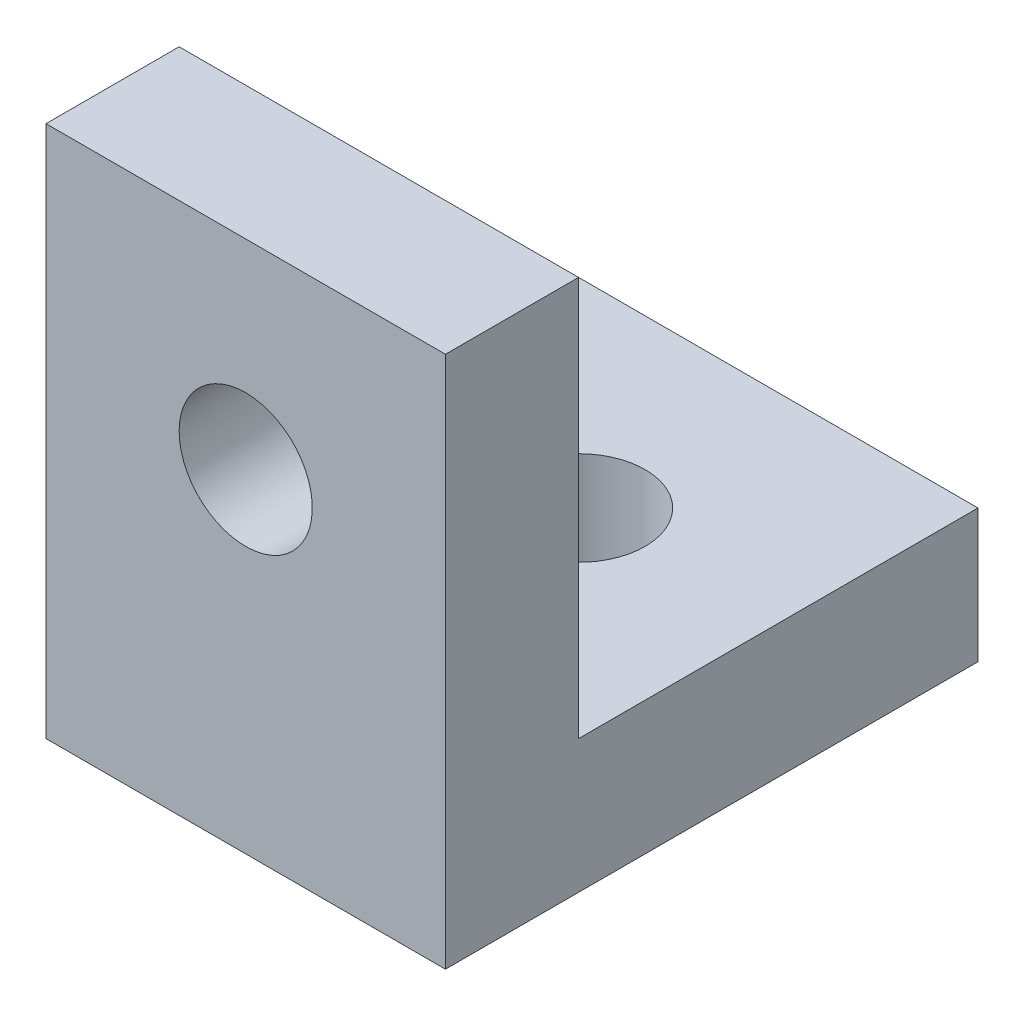
ISO-10303-21;
HEADER;
FILE_DESCRIPTION(('STEP AP214'),'2;1');
FILE_NAME('part.step','',(''),(''),'','','');
FILE_SCHEMA(('AUTOMOTIVE_DESIGN { 1 0 10303 214 1 1 1 1 }'));
ENDSEC;
DATA;
#1=APPLICATION_CONTEXT('core data for automotive mechanical design processes');
#2=APPLICATION_PROTOCOL_DEFINITION('international standard','automotive_design',2000,#1);
#3=PRODUCT_CONTEXT('',#1,'mechanical');
#4=PRODUCT('Part','Part','',(#3));
#5=PRODUCT_RELATED_PRODUCT_CATEGORY('part','',(#4));
#6=PRODUCT_DEFINITION_FORMATION('','',#4);
#7=PRODUCT_DEFINITION_CONTEXT('part definition',#1,'design');
#8=PRODUCT_DEFINITION('design','',#6,#7);
#9=PRODUCT_DEFINITION_SHAPE('','',#8);
#10=(LENGTH_UNIT() NAMED_UNIT(*) SI_UNIT(.MILLI.,.METRE.));
#11=(NAMED_UNIT(*) PLANE_ANGLE_UNIT() SI_UNIT($,.RADIAN.));
#12=(NAMED_UNIT(*) SI_UNIT($,.STERADIAN.) SOLID_ANGLE_UNIT());
#13=UNCERTAINTY_MEASURE_WITH_UNIT(LENGTH_MEASURE(1.E-05),#10,'distance_accuracy_value','');
#14=(GEOMETRIC_REPRESENTATION_CONTEXT(3) GLOBAL_UNCERTAINTY_ASSIGNED_CONTEXT((#13)) GLOBAL_UNIT_ASSIGNED_CONTEXT((#10,
#11,#12)) REPRESENTATION_CONTEXT('',''));
#15=CARTESIAN_POINT('',(0.,0.,0.));
#16=DIRECTION('',(0.,0.,1.));
#17=DIRECTION('',(1.,0.,0.));
#18=AXIS2_PLACEMENT_3D('',#15,#16,#17);
#19=CARTESIAN_POINT('',(30.,0.,-40.));
#20=DIRECTION('',(0.,1.,0.));
#21=DIRECTION('',(0.,0.,1.));
#22=AXIS2_PLACEMENT_3D('',#19,#20,#21);
#23=PLANE('',#22);
#24=CARTESIAN_POINT('',(15.,0.,-25.));
#25=DIRECTION('',(0.,1.,0.));
#26=DIRECTION('',(0.,0.,1.));
#27=AXIS2_PLACEMENT_3D('',#24,#25,#26);
#28=CIRCLE('',#27,5.);
#29=CARTESIAN_POINT('',(15.,0.,-20.));
#30=VERTEX_POINT('',#29);
#31=EDGE_CURVE('E183',#30,#30,#28,.T.);
#32=ORIENTED_EDGE('',*,*,#31,.T.);
#33=EDGE_LOOP('',(#32));
#34=FACE_BOUND('',#33,.T.);
#35=DIRECTION('',(0.,0.,-1.));
#36=VECTOR('',#35,1.);
#37=CARTESIAN_POINT('',(0.,0.,-40.));
#38=LINE('',#37,#36);
#39=CARTESIAN_POINT('',(0.,0.,0.));
#40=VERTEX_POINT('',#39);
#41=CARTESIAN_POINT('',(0.,0.,-40.));
#42=VERTEX_POINT('',#41);
#43=EDGE_CURVE('E129',#40,#42,#38,.T.);
#44=ORIENTED_EDGE('',*,*,#43,.T.);
#45=DIRECTION('',(-1.,0.,0.));
#46=VECTOR('',#45,1.);
#47=CARTESIAN_POINT('',(30.,0.,-40.));
#48=LINE('',#47,#46);
#49=CARTESIAN_POINT('',(30.,0.,-40.));
#50=VERTEX_POINT('',#49);
#51=EDGE_CURVE('E11',#50,#42,#48,.T.);
#52=ORIENTED_EDGE('',*,*,#51,.F.);
#53=DIRECTION('',(0.,0.,-1.));
#54=VECTOR('',#53,1.);
#55=CARTESIAN_POINT('',(30.,0.,-40.));
#56=LINE('',#55,#54);
#57=CARTESIAN_POINT('',(30.,0.,0.));
#58=VERTEX_POINT('',#57);
#59=EDGE_CURVE('E145',#58,#50,#56,.T.);
#60=ORIENTED_EDGE('',*,*,#59,.F.);
#61=DIRECTION('',(-1.,0.,0.));
#62=VECTOR('',#61,1.);
#63=CARTESIAN_POINT('',(30.,0.,0.));
#64=LINE('',#63,#62);
#65=EDGE_CURVE('E125',#58,#40,#64,.T.);
#66=ORIENTED_EDGE('',*,*,#65,.T.);
#67=EDGE_LOOP('',(#44,#52,#60,#66));
#68=FACE_BOUND('',#67,.T.);
#69=ADVANCED_FACE('F39',(#34,#68),#23,.F.);
#70=CARTESIAN_POINT('',(30.,10.,-40.));
#71=DIRECTION('',(0.,0.,1.));
#72=DIRECTION('',(1.,0.,0.));
#73=AXIS2_PLACEMENT_3D('',#70,#71,#72);
#74=PLANE('',#73);
#75=DIRECTION('',(0.,1.,0.));
#76=VECTOR('',#75,1.);
#77=CARTESIAN_POINT('',(0.,10.,-40.));
#78=LINE('',#77,#76);
#79=CARTESIAN_POINT('',(0.,10.,-40.));
#80=VERTEX_POINT('',#79);
#81=EDGE_CURVE('E133',#42,#80,#78,.T.);
#82=ORIENTED_EDGE('',*,*,#81,.T.);
#83=DIRECTION('',(-1.,0.,0.));
#84=VECTOR('',#83,1.);
#85=CARTESIAN_POINT('',(30.,10.,-40.));
#86=LINE('',#85,#84);
#87=CARTESIAN_POINT('',(30.,10.,-40.));
#88=VERTEX_POINT('',#87);
#89=EDGE_CURVE('E49',#88,#80,#86,.T.);
#90=ORIENTED_EDGE('',*,*,#89,.F.);
#91=DIRECTION('',(0.,1.,0.));
#92=VECTOR('',#91,1.);
#93=CARTESIAN_POINT('',(30.,10.,-40.));
#94=LINE('',#93,#92);
#95=EDGE_CURVE('E94',#50,#88,#94,.T.);
#96=ORIENTED_EDGE('',*,*,#95,.F.);
#97=ORIENTED_EDGE('',*,*,#51,.T.);
#98=EDGE_LOOP('',(#82,#90,#96,#97));
#99=FACE_BOUND('',#98,.T.);
#100=ADVANCED_FACE('F176',(#99),#74,.F.);
#101=CARTESIAN_POINT('',(30.,10.,-10.));
#102=DIRECTION('',(0.,-1.,0.));
#103=DIRECTION('',(0.,0.,-1.));
#104=AXIS2_PLACEMENT_3D('',#101,#102,#103);
#105=PLANE('',#104);
#106=CARTESIAN_POINT('',(15.,10.,-25.));
#107=DIRECTION('',(0.,1.,0.));
#108=DIRECTION('',(0.,0.,1.));
#109=AXIS2_PLACEMENT_3D('',#106,#107,#108);
#110=CIRCLE('',#109,5.);
#111=CARTESIAN_POINT('',(15.,10.,-20.));
#112=VERTEX_POINT('',#111);
#113=EDGE_CURVE('E187',#112,#112,#110,.T.);
#114=ORIENTED_EDGE('',*,*,#113,.F.);
#115=EDGE_LOOP('',(#114));
#116=FACE_BOUND('',#115,.T.);
#117=DIRECTION('',(0.,0.,1.));
#118=VECTOR('',#117,1.);
#119=CARTESIAN_POINT('',(0.,10.,-10.));
#120=LINE('',#119,#118);
#121=CARTESIAN_POINT('',(0.,10.,-10.));
#122=VERTEX_POINT('',#121);
#123=EDGE_CURVE('E136',#80,#122,#120,.T.);
#124=ORIENTED_EDGE('',*,*,#123,.T.);
#125=DIRECTION('',(-1.,0.,0.));
#126=VECTOR('',#125,1.);
#127=CARTESIAN_POINT('',(30.,10.,-10.));
#128=LINE('',#127,#126);
#129=CARTESIAN_POINT('',(30.,10.,-10.));
#130=VERTEX_POINT('',#129);
#131=EDGE_CURVE('E118',#130,#122,#128,.T.);
#132=ORIENTED_EDGE('',*,*,#131,.F.);
#133=DIRECTION('',(0.,0.,1.));
#134=VECTOR('',#133,1.);
#135=CARTESIAN_POINT('',(30.,10.,-10.));
#136=LINE('',#135,#134);
#137=EDGE_CURVE('E107',#88,#130,#136,.T.);
#138=ORIENTED_EDGE('',*,*,#137,.F.);
#139=ORIENTED_EDGE('',*,*,#89,.T.);
#140=EDGE_LOOP('',(#124,#132,#138,#139));
#141=FACE_BOUND('',#140,.T.);
#142=ADVANCED_FACE('F156',(#116,#141),#105,.F.);
#143=CARTESIAN_POINT('',(30.,40.,-10.));
#144=DIRECTION('',(0.,0.,1.));
#145=DIRECTION('',(0.,-1.,0.));
#146=AXIS2_PLACEMENT_3D('',#143,#144,#145);
#147=PLANE('',#146);
#148=CARTESIAN_POINT('',(15.,25.,-10.));
#149=DIRECTION('',(0.,0.,-1.));
#150=DIRECTION('',(0.,1.,0.));
#151=AXIS2_PLACEMENT_3D('',#148,#149,#150);
#152=CIRCLE('',#151,5.);
#153=CARTESIAN_POINT('',(15.,30.,-10.));
#154=VERTEX_POINT('',#153);
#155=EDGE_CURVE('E186',#154,#154,#152,.T.);
#156=ORIENTED_EDGE('',*,*,#155,.F.);
#157=EDGE_LOOP('',(#156));
#158=FACE_BOUND('',#157,.T.);
#159=DIRECTION('',(0.,1.,0.));
#160=VECTOR('',#159,1.);
#161=CARTESIAN_POINT('',(0.,40.,-10.));
#162=LINE('',#161,#160);
#163=CARTESIAN_POINT('',(0.,40.,-10.));
#164=VERTEX_POINT('',#163);
#165=EDGE_CURVE('E116',#122,#164,#162,.T.);
#166=ORIENTED_EDGE('',*,*,#165,.T.);
#167=DIRECTION('',(-1.,0.,0.));
#168=VECTOR('',#167,1.);
#169=CARTESIAN_POINT('',(30.,40.,-10.));
#170=LINE('',#169,#168);
#171=CARTESIAN_POINT('',(30.,40.,-10.));
#172=VERTEX_POINT('',#171);
#173=EDGE_CURVE('E113',#172,#164,#170,.T.);
#174=ORIENTED_EDGE('',*,*,#173,.F.);
#175=DIRECTION('',(0.,1.,0.));
#176=VECTOR('',#175,1.);
#177=CARTESIAN_POINT('',(30.,40.,-10.));
#178=LINE('',#177,#176);
#179=EDGE_CURVE('E101',#130,#172,#178,.T.);
#180=ORIENTED_EDGE('',*,*,#179,.F.);
#181=ORIENTED_EDGE('',*,*,#131,.T.);
#182=EDGE_LOOP('',(#166,#174,#180,#181));
#183=FACE_BOUND('',#182,.T.);
#184=ADVANCED_FACE('F114',(#158,#183),#147,.F.);
#185=CARTESIAN_POINT('',(30.,40.,0.));
#186=DIRECTION('',(0.,-1.,0.));
#187=DIRECTION('',(0.,0.,-1.));
#188=AXIS2_PLACEMENT_3D('',#185,#186,#187);
#189=PLANE('',#188);
#190=DIRECTION('',(0.,0.,1.));
#191=VECTOR('',#190,1.);
#192=CARTESIAN_POINT('',(0.,40.,0.));
#193=LINE('',#192,#191);
#194=CARTESIAN_POINT('',(0.,40.,0.));
#195=VERTEX_POINT('',#194);
#196=EDGE_CURVE('E80',#164,#195,#193,.T.);
#197=ORIENTED_EDGE('',*,*,#196,.T.);
#198=DIRECTION('',(-1.,0.,0.));
#199=VECTOR('',#198,1.);
#200=CARTESIAN_POINT('',(30.,40.,0.));
#201=LINE('',#200,#199);
#202=CARTESIAN_POINT('',(30.,40.,0.));
#203=VERTEX_POINT('',#202);
#204=EDGE_CURVE('E119',#203,#195,#201,.T.);
#205=ORIENTED_EDGE('',*,*,#204,.F.);
#206=DIRECTION('',(0.,0.,1.));
#207=VECTOR('',#206,1.);
#208=CARTESIAN_POINT('',(30.,40.,0.));
#209=LINE('',#208,#207);
#210=EDGE_CURVE('E105',#172,#203,#209,.T.);
#211=ORIENTED_EDGE('',*,*,#210,.F.);
#212=ORIENTED_EDGE('',*,*,#173,.T.);
#213=EDGE_LOOP('',(#197,#205,#211,#212));
#214=FACE_BOUND('',#213,.T.);
#215=ADVANCED_FACE('F121',(#214),#189,.F.);
#216=CARTESIAN_POINT('',(30.,0.,0.));
#217=DIRECTION('',(0.,0.,-1.));
#218=DIRECTION('',(-1.,0.,0.));
#219=AXIS2_PLACEMENT_3D('',#216,#217,#218);
#220=PLANE('',#219);
#221=CARTESIAN_POINT('',(15.,25.,0.));
#222=DIRECTION('',(0.,0.,-1.));
#223=DIRECTION('',(-1.,0.,0.));
#224=AXIS2_PLACEMENT_3D('',#221,#222,#223);
#225=CIRCLE('',#224,5.);
#226=CARTESIAN_POINT('',(10.,25.,0.));
#227=VERTEX_POINT('',#226);
#228=EDGE_CURVE('E42',#227,#227,#225,.T.);
#229=ORIENTED_EDGE('',*,*,#228,.T.);
#230=EDGE_LOOP('',(#229));
#231=FACE_BOUND('',#230,.T.);
#232=DIRECTION('',(0.,-1.,0.));
#233=VECTOR('',#232,1.);
#234=CARTESIAN_POINT('',(0.,0.,0.));
#235=LINE('',#234,#233);
#236=EDGE_CURVE('E86',#195,#40,#235,.T.);
#237=ORIENTED_EDGE('',*,*,#236,.T.);
#238=ORIENTED_EDGE('',*,*,#65,.F.);
#239=DIRECTION('',(0.,-1.,0.));
#240=VECTOR('',#239,1.);
#241=CARTESIAN_POINT('',(30.,0.,0.));
#242=LINE('',#241,#240);
#243=EDGE_CURVE('E57',#203,#58,#242,.T.);
#244=ORIENTED_EDGE('',*,*,#243,.F.);
#245=ORIENTED_EDGE('',*,*,#204,.T.);
#246=EDGE_LOOP('',(#237,#238,#244,#245));
#247=FACE_BOUND('',#246,.T.);
#248=ADVANCED_FACE('F163',(#231,#247),#220,.F.);
#249=CARTESIAN_POINT('',(30.,0.,0.));
#250=DIRECTION('',(-1.,0.,0.));
#251=DIRECTION('',(0.,0.,1.));
#252=AXIS2_PLACEMENT_3D('',#249,#250,#251);
#253=PLANE('',#252);
#254=ORIENTED_EDGE('',*,*,#59,.T.);
#255=ORIENTED_EDGE('',*,*,#95,.T.);
#256=ORIENTED_EDGE('',*,*,#137,.T.);
#257=ORIENTED_EDGE('',*,*,#179,.T.);
#258=ORIENTED_EDGE('',*,*,#210,.T.);
#259=ORIENTED_EDGE('',*,*,#243,.T.);
#260=EDGE_LOOP('',(#254,#255,#256,#257,#258,#259));
#261=FACE_BOUND('',#260,.T.);
#262=ADVANCED_FACE('F103',(#261),#253,.F.);
#263=CARTESIAN_POINT('',(0.,0.,0.));
#264=DIRECTION('',(-1.,0.,0.));
#265=DIRECTION('',(0.,0.,1.));
#266=AXIS2_PLACEMENT_3D('',#263,#264,#265);
#267=PLANE('',#266);
#268=ORIENTED_EDGE('',*,*,#43,.F.);
#269=ORIENTED_EDGE('',*,*,#236,.F.);
#270=ORIENTED_EDGE('',*,*,#196,.F.);
#271=ORIENTED_EDGE('',*,*,#165,.F.);
#272=ORIENTED_EDGE('',*,*,#123,.F.);
#273=ORIENTED_EDGE('',*,*,#81,.F.);
#274=EDGE_LOOP('',(#268,#269,#270,#271,#272,#273));
#275=FACE_BOUND('',#274,.T.);
#276=ADVANCED_FACE('F159',(#275),#267,.T.);
#277=CARTESIAN_POINT('',(15.,25.,20.));
#278=DIRECTION('',(0.,0.,-1.));
#279=DIRECTION('',(0.,1.,0.));
#280=AXIS2_PLACEMENT_3D('',#277,#278,#279);
#281=CYLINDRICAL_SURFACE('',#280,5.);
#282=ORIENTED_EDGE('',*,*,#155,.T.);
#283=EDGE_LOOP('',(#282));
#284=FACE_BOUND('',#283,.T.);
#285=ORIENTED_EDGE('',*,*,#228,.F.);
#286=EDGE_LOOP('',(#285));
#287=FACE_BOUND('',#286,.T.);
#288=ADVANCED_FACE('F203',(#284,#287),#281,.F.);
#289=CARTESIAN_POINT('',(15.,-20.,-25.));
#290=DIRECTION('',(0.,1.,0.));
#291=DIRECTION('',(0.,0.,1.));
#292=AXIS2_PLACEMENT_3D('',#289,#290,#291);
#293=CYLINDRICAL_SURFACE('',#292,5.);
#294=ORIENTED_EDGE('',*,*,#113,.T.);
#295=EDGE_LOOP('',(#294));
#296=FACE_BOUND('',#295,.T.);
#297=ORIENTED_EDGE('',*,*,#31,.F.);
#298=EDGE_LOOP('',(#297));
#299=FACE_BOUND('',#298,.T.);
#300=ADVANCED_FACE('F205',(#296,#299),#293,.F.);
#301=CLOSED_SHELL('',(#69,#100,#142,#184,#215,#248,#262,#276,#288,#300));
#302=MANIFOLD_SOLID_BREP('B2',#301);
#303=ADVANCED_BREP_SHAPE_REPRESENTATION('',(#18,#302),#14);
#304=SHAPE_DEFINITION_REPRESENTATION(#9,#303);
ENDSEC;
END-ISO-10303-21;
